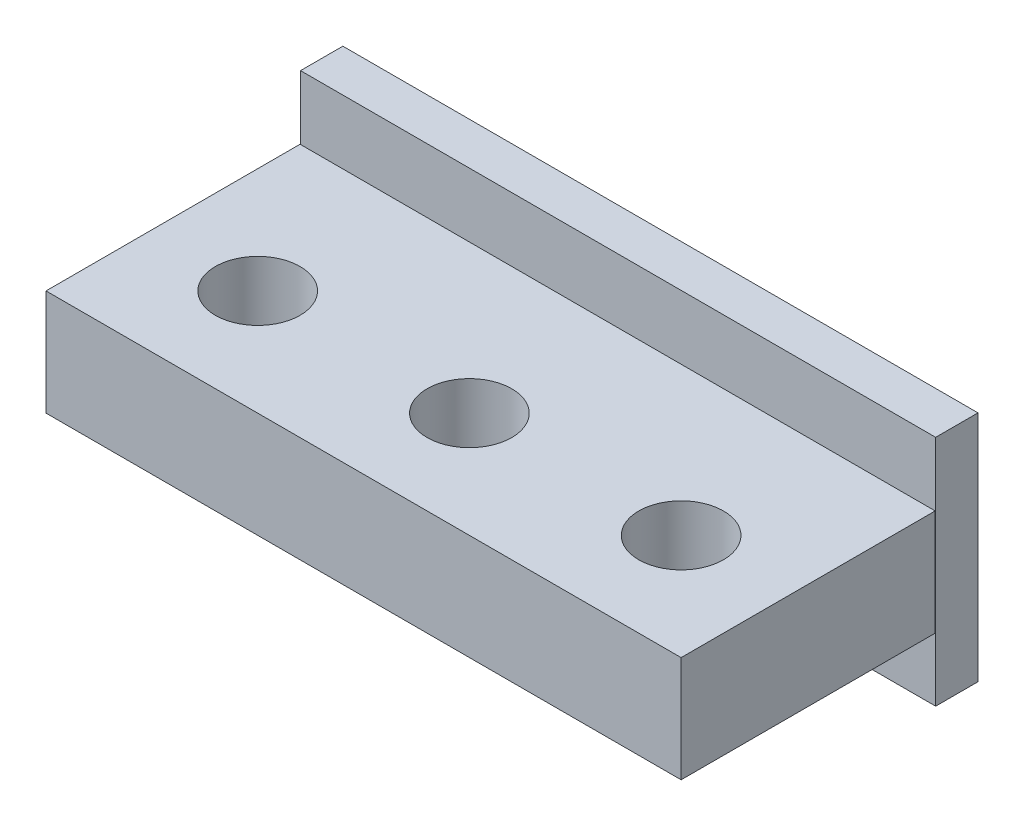
ISO-10303-21;
HEADER;
FILE_DESCRIPTION(('STEP AP214'),'2;1');
FILE_NAME('part.step','',(''),(''),'','','');
FILE_SCHEMA(('AUTOMOTIVE_DESIGN { 1 0 10303 214 1 1 1 1 }'));
ENDSEC;
DATA;
#1=APPLICATION_CONTEXT('core data for automotive mechanical design processes');
#2=APPLICATION_PROTOCOL_DEFINITION('international standard','automotive_design',2000,#1);
#3=PRODUCT_CONTEXT('',#1,'mechanical');
#4=PRODUCT('Part','Part','',(#3));
#5=PRODUCT_RELATED_PRODUCT_CATEGORY('part','',(#4));
#6=PRODUCT_DEFINITION_FORMATION('','',#4);
#7=PRODUCT_DEFINITION_CONTEXT('part definition',#1,'design');
#8=PRODUCT_DEFINITION('design','',#6,#7);
#9=PRODUCT_DEFINITION_SHAPE('','',#8);
#10=(LENGTH_UNIT() NAMED_UNIT(*) SI_UNIT(.MILLI.,.METRE.));
#11=(NAMED_UNIT(*) PLANE_ANGLE_UNIT() SI_UNIT($,.RADIAN.));
#12=(NAMED_UNIT(*) SI_UNIT($,.STERADIAN.) SOLID_ANGLE_UNIT());
#13=UNCERTAINTY_MEASURE_WITH_UNIT(LENGTH_MEASURE(1.E-05),#10,'distance_accuracy_value','');
#14=(GEOMETRIC_REPRESENTATION_CONTEXT(3) GLOBAL_UNCERTAINTY_ASSIGNED_CONTEXT((#13)) GLOBAL_UNIT_ASSIGNED_CONTEXT((#10,
#11,#12)) REPRESENTATION_CONTEXT('',''));
#15=CARTESIAN_POINT('',(0.,0.,0.));
#16=DIRECTION('',(0.,0.,1.));
#17=DIRECTION('',(1.,0.,0.));
#18=AXIS2_PLACEMENT_3D('',#15,#16,#17);
#19=CARTESIAN_POINT('',(-7.1712328677664,5.,10.9891849490103));
#20=DIRECTION('',(1.,0.,0.));
#21=DIRECTION('',(0.,0.,-1.));
#22=AXIS2_PLACEMENT_3D('',#19,#20,#21);
#23=PLANE('',#22);
#24=DIRECTION('',(0.,0.,1.));
#25=VECTOR('',#24,1.);
#26=CARTESIAN_POINT('',(-7.1712328677664,0.,10.9891849490103));
#27=LINE('',#26,#25);
#28=CARTESIAN_POINT('',(-7.1712328677664,0.,10.9891849490103));
#29=VERTEX_POINT('',#28);
#30=CARTESIAN_POINT('',(-7.1712328677664,0.,22.9891849490103));
#31=VERTEX_POINT('',#30);
#32=EDGE_CURVE('E141',#29,#31,#27,.T.);
#33=ORIENTED_EDGE('',*,*,#32,.T.);
#34=DIRECTION('',(0.,-1.,0.));
#35=VECTOR('',#34,1.);
#36=CARTESIAN_POINT('',(-7.1712328677664,5.,22.9891849490103));
#37=LINE('',#36,#35);
#38=CARTESIAN_POINT('',(-7.1712328677664,5.,22.9891849490103));
#39=VERTEX_POINT('',#38);
#40=EDGE_CURVE('E9',#39,#31,#37,.T.);
#41=ORIENTED_EDGE('',*,*,#40,.F.);
#42=DIRECTION('',(0.,0.,1.));
#43=VECTOR('',#42,1.);
#44=CARTESIAN_POINT('',(-7.1712328677664,5.,10.9891849490103));
#45=LINE('',#44,#43);
#46=CARTESIAN_POINT('',(-7.1712328677664,5.,10.9891849490103));
#47=VERTEX_POINT('',#46);
#48=EDGE_CURVE('E146',#47,#39,#45,.T.);
#49=ORIENTED_EDGE('',*,*,#48,.F.);
#50=DIRECTION('',(0.,-1.,0.));
#51=VECTOR('',#50,1.);
#52=CARTESIAN_POINT('',(-7.1712328677664,5.,10.9891849490103));
#53=LINE('',#52,#51);
#54=EDGE_CURVE('E149',#47,#29,#53,.T.);
#55=ORIENTED_EDGE('',*,*,#54,.T.);
#56=EDGE_LOOP('',(#33,#41,#49,#55));
#57=FACE_BOUND('',#56,.T.);
#58=ADVANCED_FACE('F15',(#57),#23,.F.);
#59=CARTESIAN_POINT('',(-7.1712328677664,5.,22.9891849490103));
#60=DIRECTION('',(0.,0.,-1.));
#61=DIRECTION('',(-1.,0.,0.));
#62=AXIS2_PLACEMENT_3D('',#59,#60,#61);
#63=PLANE('',#62);
#64=DIRECTION('',(1.,0.,0.));
#65=VECTOR('',#64,1.);
#66=CARTESIAN_POINT('',(-7.1712328677664,0.,22.9891849490103));
#67=LINE('',#66,#65);
#68=CARTESIAN_POINT('',(22.8287671322336,0.,22.9891849490103));
#69=VERTEX_POINT('',#68);
#70=EDGE_CURVE('E152',#31,#69,#67,.T.);
#71=ORIENTED_EDGE('',*,*,#70,.T.);
#72=DIRECTION('',(0.,-1.,0.));
#73=VECTOR('',#72,1.);
#74=CARTESIAN_POINT('',(22.8287671322336,5.,22.9891849490103));
#75=LINE('',#74,#73);
#76=CARTESIAN_POINT('',(22.8287671322336,5.,22.9891849490103));
#77=VERTEX_POINT('',#76);
#78=EDGE_CURVE('E25',#77,#69,#75,.T.);
#79=ORIENTED_EDGE('',*,*,#78,.F.);
#80=DIRECTION('',(1.,0.,0.));
#81=VECTOR('',#80,1.);
#82=CARTESIAN_POINT('',(-7.1712328677664,5.,22.9891849490103));
#83=LINE('',#82,#81);
#84=EDGE_CURVE('E142',#39,#77,#83,.T.);
#85=ORIENTED_EDGE('',*,*,#84,.F.);
#86=ORIENTED_EDGE('',*,*,#40,.T.);
#87=EDGE_LOOP('',(#71,#79,#85,#86));
#88=FACE_BOUND('',#87,.T.);
#89=ADVANCED_FACE('F359',(#88),#63,.F.);
#90=CARTESIAN_POINT('',(22.8287671322336,5.,22.9891849490103));
#91=DIRECTION('',(-1.,0.,0.));
#92=DIRECTION('',(0.,0.,1.));
#93=AXIS2_PLACEMENT_3D('',#90,#91,#92);
#94=PLANE('',#93);
#95=DIRECTION('',(0.,0.,-1.));
#96=VECTOR('',#95,1.);
#97=CARTESIAN_POINT('',(22.8287671322336,0.,22.9891849490103));
#98=LINE('',#97,#96);
#99=CARTESIAN_POINT('',(22.8287671322336,0.,10.9891849490103));
#100=VERTEX_POINT('',#99);
#101=EDGE_CURVE('E155',#69,#100,#98,.T.);
#102=ORIENTED_EDGE('',*,*,#101,.T.);
#103=DIRECTION('',(0.,-1.,0.));
#104=VECTOR('',#103,1.);
#105=CARTESIAN_POINT('',(22.8287671322336,5.,10.9891849490103));
#106=LINE('',#105,#104);
#107=CARTESIAN_POINT('',(22.8287671322336,5.,10.9891849490103));
#108=VERTEX_POINT('',#107);
#109=EDGE_CURVE('E165',#108,#100,#106,.T.);
#110=ORIENTED_EDGE('',*,*,#109,.F.);
#111=DIRECTION('',(0.,0.,-1.));
#112=VECTOR('',#111,1.);
#113=CARTESIAN_POINT('',(22.8287671322336,5.,22.9891849490103));
#114=LINE('',#113,#112);
#115=EDGE_CURVE('E145',#77,#108,#114,.T.);
#116=ORIENTED_EDGE('',*,*,#115,.F.);
#117=ORIENTED_EDGE('',*,*,#78,.T.);
#118=EDGE_LOOP('',(#102,#110,#116,#117));
#119=FACE_BOUND('',#118,.T.);
#120=ADVANCED_FACE('F347',(#119),#94,.F.);
#121=CARTESIAN_POINT('',(22.8287671322336,5.,10.9891849490103));
#122=DIRECTION('',(0.,0.,1.));
#123=DIRECTION('',(1.,0.,0.));
#124=AXIS2_PLACEMENT_3D('',#121,#122,#123);
#125=PLANE('',#124);
#126=DIRECTION('',(-1.,0.,0.));
#127=VECTOR('',#126,1.);
#128=CARTESIAN_POINT('',(22.8287671322336,0.,10.9891849490103));
#129=LINE('',#128,#127);
#130=EDGE_CURVE('E151',#100,#29,#129,.T.);
#131=ORIENTED_EDGE('',*,*,#130,.T.);
#132=ORIENTED_EDGE('',*,*,#54,.F.);
#133=DIRECTION('',(-1.,0.,0.));
#134=VECTOR('',#133,1.);
#135=CARTESIAN_POINT('',(22.8287671322336,5.,10.9891849490103));
#136=LINE('',#135,#134);
#137=EDGE_CURVE('E34',#108,#47,#136,.T.);
#138=ORIENTED_EDGE('',*,*,#137,.F.);
#139=ORIENTED_EDGE('',*,*,#109,.T.);
#140=EDGE_LOOP('',(#131,#132,#138,#139));
#141=FACE_BOUND('',#140,.T.);
#142=ADVANCED_FACE('F312',(#141),#125,.F.);
#143=CARTESIAN_POINT('',(0.,5.,0.));
#144=DIRECTION('',(0.,1.,0.));
#145=DIRECTION('',(0.,0.,1.));
#146=AXIS2_PLACEMENT_3D('',#143,#144,#145);
#147=PLANE('',#146);
#148=CARTESIAN_POINT('',(17.8287671322336,5.,17.9891849490103));
#149=DIRECTION('',(0.,1.,0.));
#150=DIRECTION('',(0.,0.,1.));
#151=AXIS2_PLACEMENT_3D('',#148,#149,#150);
#152=CIRCLE('',#151,2.);
#153=CARTESIAN_POINT('',(17.8287671322336,5.,19.9891849490103));
#154=VERTEX_POINT('',#153);
#155=EDGE_CURVE('E119',#154,#154,#152,.T.);
#156=ORIENTED_EDGE('',*,*,#155,.F.);
#157=EDGE_LOOP('',(#156));
#158=FACE_BOUND('',#157,.T.);
#159=CARTESIAN_POINT('',(7.8287671322336,5.,17.9891849490103));
#160=DIRECTION('',(0.,1.,0.));
#161=DIRECTION('',(0.,0.,1.));
#162=AXIS2_PLACEMENT_3D('',#159,#160,#161);
#163=CIRCLE('',#162,2.);
#164=CARTESIAN_POINT('',(7.8287671322336,5.,19.9891849490103));
#165=VERTEX_POINT('',#164);
#166=EDGE_CURVE('E131',#165,#165,#163,.T.);
#167=ORIENTED_EDGE('',*,*,#166,.F.);
#168=EDGE_LOOP('',(#167));
#169=FACE_BOUND('',#168,.T.);
#170=CARTESIAN_POINT('',(-2.1712328677664,5.,17.9891849490103));
#171=DIRECTION('',(0.,1.,0.));
#172=DIRECTION('',(0.,0.,1.));
#173=AXIS2_PLACEMENT_3D('',#170,#171,#172);
#174=CIRCLE('',#173,2.);
#175=CARTESIAN_POINT('',(-2.1712328677664,5.,19.9891849490103));
#176=VERTEX_POINT('',#175);
#177=EDGE_CURVE('E138',#176,#176,#174,.T.);
#178=ORIENTED_EDGE('',*,*,#177,.F.);
#179=EDGE_LOOP('',(#178));
#180=FACE_BOUND('',#179,.T.);
#181=ORIENTED_EDGE('',*,*,#48,.T.);
#182=ORIENTED_EDGE('',*,*,#84,.T.);
#183=ORIENTED_EDGE('',*,*,#115,.T.);
#184=ORIENTED_EDGE('',*,*,#137,.T.);
#185=EDGE_LOOP('',(#181,#182,#183,#184));
#186=FACE_BOUND('',#185,.T.);
#187=ADVANCED_FACE('F298',(#158,#169,#180,#186),#147,.T.);
#188=CARTESIAN_POINT('',(0.,0.,0.));
#189=DIRECTION('',(0.,1.,0.));
#190=DIRECTION('',(0.,0.,1.));
#191=AXIS2_PLACEMENT_3D('',#188,#189,#190);
#192=PLANE('',#191);
#193=CARTESIAN_POINT('',(17.8287671322336,0.,17.9891849490103));
#194=DIRECTION('',(0.,-1.,0.));
#195=DIRECTION('',(1.,0.,0.));
#196=AXIS2_PLACEMENT_3D('',#193,#194,#195);
#197=CIRCLE('',#196,2.);
#198=CARTESIAN_POINT('',(19.8287671322336,0.,17.9891849490103));
#199=VERTEX_POINT('',#198);
#200=EDGE_CURVE('E115',#199,#199,#197,.T.);
#201=ORIENTED_EDGE('',*,*,#200,.F.);
#202=EDGE_LOOP('',(#201));
#203=FACE_BOUND('',#202,.T.);
#204=CARTESIAN_POINT('',(7.8287671322336,0.,17.9891849490103));
#205=DIRECTION('',(0.,-1.,0.));
#206=DIRECTION('',(1.,0.,0.));
#207=AXIS2_PLACEMENT_3D('',#204,#205,#206);
#208=CIRCLE('',#207,2.);
#209=CARTESIAN_POINT('',(9.8287671322336,0.,17.9891849490103));
#210=VERTEX_POINT('',#209);
#211=EDGE_CURVE('E126',#210,#210,#208,.T.);
#212=ORIENTED_EDGE('',*,*,#211,.F.);
#213=EDGE_LOOP('',(#212));
#214=FACE_BOUND('',#213,.T.);
#215=CARTESIAN_POINT('',(-2.1712328677664,0.,17.9891849490103));
#216=DIRECTION('',(0.,-1.,0.));
#217=DIRECTION('',(1.,0.,0.));
#218=AXIS2_PLACEMENT_3D('',#215,#216,#217);
#219=CIRCLE('',#218,2.);
#220=CARTESIAN_POINT('',(-0.171232867766404,0.,17.9891849490103));
#221=VERTEX_POINT('',#220);
#222=EDGE_CURVE('E134',#221,#221,#219,.T.);
#223=ORIENTED_EDGE('',*,*,#222,.F.);
#224=EDGE_LOOP('',(#223));
#225=FACE_BOUND('',#224,.T.);
#226=ORIENTED_EDGE('',*,*,#32,.F.);
#227=ORIENTED_EDGE('',*,*,#130,.F.);
#228=ORIENTED_EDGE('',*,*,#101,.F.);
#229=ORIENTED_EDGE('',*,*,#70,.F.);
#230=EDGE_LOOP('',(#226,#227,#228,#229));
#231=FACE_BOUND('',#230,.T.);
#232=ADVANCED_FACE('F292',(#203,#214,#225,#231),#192,.F.);
#233=CARTESIAN_POINT('',(-2.1712328677664,32.6955654485436,17.9891849490103));
#234=DIRECTION('',(0.,-1.,0.));
#235=DIRECTION('',(0.,0.,-1.));
#236=AXIS2_PLACEMENT_3D('',#233,#234,#235);
#237=CYLINDRICAL_SURFACE('',#236,2.);
#238=ORIENTED_EDGE('',*,*,#222,.T.);
#239=EDGE_LOOP('',(#238));
#240=FACE_BOUND('',#239,.T.);
#241=ORIENTED_EDGE('',*,*,#177,.T.);
#242=EDGE_LOOP('',(#241));
#243=FACE_BOUND('',#242,.T.);
#244=ADVANCED_FACE('F297',(#240,#243),#237,.F.);
#245=CARTESIAN_POINT('',(7.8287671322336,32.6955654485436,17.9891849490103));
#246=DIRECTION('',(0.,-1.,0.));
#247=DIRECTION('',(0.,0.,-1.));
#248=AXIS2_PLACEMENT_3D('',#245,#246,#247);
#249=CYLINDRICAL_SURFACE('',#248,2.);
#250=ORIENTED_EDGE('',*,*,#211,.T.);
#251=EDGE_LOOP('',(#250));
#252=FACE_BOUND('',#251,.T.);
#253=ORIENTED_EDGE('',*,*,#166,.T.);
#254=EDGE_LOOP('',(#253));
#255=FACE_BOUND('',#254,.T.);
#256=ADVANCED_FACE('F280',(#252,#255),#249,.F.);
#257=CARTESIAN_POINT('',(17.8287671322336,32.6955654485436,17.9891849490103));
#258=DIRECTION('',(0.,-1.,0.));
#259=DIRECTION('',(0.,0.,-1.));
#260=AXIS2_PLACEMENT_3D('',#257,#258,#259);
#261=CYLINDRICAL_SURFACE('',#260,2.);
#262=ORIENTED_EDGE('',*,*,#200,.T.);
#263=EDGE_LOOP('',(#262));
#264=FACE_BOUND('',#263,.T.);
#265=ORIENTED_EDGE('',*,*,#155,.T.);
#266=EDGE_LOOP('',(#265));
#267=FACE_BOUND('',#266,.T.);
#268=ADVANCED_FACE('F206',(#264,#267),#261,.F.);
#269=CLOSED_SHELL('',(#58,#89,#120,#142,#187,#232,#244,#256,#268));
#270=MANIFOLD_SOLID_BREP('B1',#269);
#271=CARTESIAN_POINT('',(-7.1712328677664,-3.,8.96661962834522));
#272=DIRECTION('',(0.,1.,0.));
#273=DIRECTION('',(0.,0.,1.));
#274=AXIS2_PLACEMENT_3D('',#271,#272,#273);
#275=PLANE('',#274);
#276=DIRECTION('',(0.,0.,1.));
#277=VECTOR('',#276,1.);
#278=CARTESIAN_POINT('',(22.8287671322336,-3.,8.96661962834524));
#279=LINE('',#278,#277);
#280=CARTESIAN_POINT('',(22.8287671322336,-3.,8.96661962834524));
#281=VERTEX_POINT('',#280);
#282=CARTESIAN_POINT('',(22.8287671322336,-3.,10.9666196283452));
#283=VERTEX_POINT('',#282);
#284=EDGE_CURVE('E97',#281,#283,#279,.T.);
#285=ORIENTED_EDGE('',*,*,#284,.T.);
#286=DIRECTION('',(1.,0.,0.));
#287=VECTOR('',#286,1.);
#288=CARTESIAN_POINT('',(-7.1712328677664,-3.,10.9666196283452));
#289=LINE('',#288,#287);
#290=CARTESIAN_POINT('',(-7.1712328677664,-3.,10.9666196283452));
#291=VERTEX_POINT('',#290);
#292=EDGE_CURVE('E19',#291,#283,#289,.T.);
#293=ORIENTED_EDGE('',*,*,#292,.F.);
#294=DIRECTION('',(0.,0.,1.));
#295=VECTOR('',#294,1.);
#296=CARTESIAN_POINT('',(-7.1712328677664,-3.,8.96661962834522));
#297=LINE('',#296,#295);
#298=CARTESIAN_POINT('',(-7.1712328677664,-3.,8.96661962834522));
#299=VERTEX_POINT('',#298);
#300=EDGE_CURVE('E92',#299,#291,#297,.T.);
#301=ORIENTED_EDGE('',*,*,#300,.F.);
#302=DIRECTION('',(1.,0.,0.));
#303=VECTOR('',#302,1.);
#304=CARTESIAN_POINT('',(-7.1712328677664,-3.,8.96661962834522));
#305=LINE('',#304,#303);
#306=EDGE_CURVE('E86',#299,#281,#305,.T.);
#307=ORIENTED_EDGE('',*,*,#306,.T.);
#308=EDGE_LOOP('',(#285,#293,#301,#307));
#309=FACE_BOUND('',#308,.T.);
#310=ADVANCED_FACE('F17',(#309),#275,.F.);
#311=CARTESIAN_POINT('',(-7.1712328677664,-3.,10.9666196283452));
#312=DIRECTION('',(0.,0.,-1.));
#313=DIRECTION('',(-1.,0.,0.));
#314=AXIS2_PLACEMENT_3D('',#311,#312,#313);
#315=PLANE('',#314);
#316=DIRECTION('',(0.,1.,0.));
#317=VECTOR('',#316,1.);
#318=CARTESIAN_POINT('',(22.8287671322336,-3.,10.9666196283452));
#319=LINE('',#318,#317);
#320=CARTESIAN_POINT('',(22.8287671322336,8.,10.9666196283452));
#321=VERTEX_POINT('',#320);
#322=EDGE_CURVE('E102',#283,#321,#319,.T.);
#323=ORIENTED_EDGE('',*,*,#322,.T.);
#324=DIRECTION('',(1.,0.,0.));
#325=VECTOR('',#324,1.);
#326=CARTESIAN_POINT('',(-7.1712328677664,8.,10.9666196283452));
#327=LINE('',#326,#325);
#328=CARTESIAN_POINT('',(-7.1712328677664,8.,10.9666196283452));
#329=VERTEX_POINT('',#328);
#330=EDGE_CURVE('E112',#329,#321,#327,.T.);
#331=ORIENTED_EDGE('',*,*,#330,.F.);
#332=DIRECTION('',(0.,1.,0.));
#333=VECTOR('',#332,1.);
#334=CARTESIAN_POINT('',(-7.1712328677664,-3.,10.9666196283452));
#335=LINE('',#334,#333);
#336=EDGE_CURVE('E170',#291,#329,#335,.T.);
#337=ORIENTED_EDGE('',*,*,#336,.F.);
#338=ORIENTED_EDGE('',*,*,#292,.T.);
#339=EDGE_LOOP('',(#323,#331,#337,#338));
#340=FACE_BOUND('',#339,.T.);
#341=ADVANCED_FACE('F185',(#340),#315,.F.);
#342=CARTESIAN_POINT('',(-7.1712328677664,8.,10.9666196283452));
#343=DIRECTION('',(0.,-1.,0.));
#344=DIRECTION('',(0.,0.,-1.));
#345=AXIS2_PLACEMENT_3D('',#342,#343,#344);
#346=PLANE('',#345);
#347=DIRECTION('',(0.,0.,-1.));
#348=VECTOR('',#347,1.);
#349=CARTESIAN_POINT('',(22.8287671322336,8.,10.9666196283452));
#350=LINE('',#349,#348);
#351=CARTESIAN_POINT('',(22.8287671322336,8.,8.96661962834524));
#352=VERTEX_POINT('',#351);
#353=EDGE_CURVE('E76',#321,#352,#350,.T.);
#354=ORIENTED_EDGE('',*,*,#353,.T.);
#355=DIRECTION('',(1.,0.,0.));
#356=VECTOR('',#355,1.);
#357=CARTESIAN_POINT('',(-7.1712328677664,8.,8.96661962834523));
#358=LINE('',#357,#356);
#359=CARTESIAN_POINT('',(-7.1712328677664,8.,8.96661962834523));
#360=VERTEX_POINT('',#359);
#361=EDGE_CURVE('E88',#360,#352,#358,.T.);
#362=ORIENTED_EDGE('',*,*,#361,.F.);
#363=DIRECTION('',(0.,0.,-1.));
#364=VECTOR('',#363,1.);
#365=CARTESIAN_POINT('',(-7.1712328677664,8.,10.9666196283452));
#366=LINE('',#365,#364);
#367=EDGE_CURVE('E172',#329,#360,#366,.T.);
#368=ORIENTED_EDGE('',*,*,#367,.F.);
#369=ORIENTED_EDGE('',*,*,#330,.T.);
#370=EDGE_LOOP('',(#354,#362,#368,#369));
#371=FACE_BOUND('',#370,.T.);
#372=ADVANCED_FACE('F183',(#371),#346,.F.);
#373=CARTESIAN_POINT('',(-7.1712328677664,8.,8.96661962834523));
#374=DIRECTION('',(0.,0.,1.));
#375=DIRECTION('',(1.,0.,0.));
#376=AXIS2_PLACEMENT_3D('',#373,#374,#375);
#377=PLANE('',#376);
#378=DIRECTION('',(0.,-1.,0.));
#379=VECTOR('',#378,1.);
#380=CARTESIAN_POINT('',(22.8287671322336,8.,8.96661962834524));
#381=LINE('',#380,#379);
#382=EDGE_CURVE('E82',#352,#281,#381,.T.);
#383=ORIENTED_EDGE('',*,*,#382,.T.);
#384=ORIENTED_EDGE('',*,*,#306,.F.);
#385=DIRECTION('',(0.,-1.,0.));
#386=VECTOR('',#385,1.);
#387=CARTESIAN_POINT('',(-7.1712328677664,8.,8.96661962834523));
#388=LINE('',#387,#386);
#389=EDGE_CURVE('E99',#360,#299,#388,.T.);
#390=ORIENTED_EDGE('',*,*,#389,.F.);
#391=ORIENTED_EDGE('',*,*,#361,.T.);
#392=EDGE_LOOP('',(#383,#384,#390,#391));
#393=FACE_BOUND('',#392,.T.);
#394=ADVANCED_FACE('F84',(#393),#377,.F.);
#395=CARTESIAN_POINT('',(-7.1712328677664,0.,0.));
#396=DIRECTION('',(-1.,0.,0.));
#397=DIRECTION('',(0.,0.,1.));
#398=AXIS2_PLACEMENT_3D('',#395,#396,#397);
#399=PLANE('',#398);
#400=ORIENTED_EDGE('',*,*,#300,.T.);
#401=ORIENTED_EDGE('',*,*,#336,.T.);
#402=ORIENTED_EDGE('',*,*,#367,.T.);
#403=ORIENTED_EDGE('',*,*,#389,.T.);
#404=EDGE_LOOP('',(#400,#401,#402,#403));
#405=FACE_BOUND('',#404,.T.);
#406=ADVANCED_FACE('F182',(#405),#399,.T.);
#407=CARTESIAN_POINT('',(22.8287671322336,0.,0.));
#408=DIRECTION('',(-1.,0.,0.));
#409=DIRECTION('',(0.,0.,1.));
#410=AXIS2_PLACEMENT_3D('',#407,#408,#409);
#411=PLANE('',#410);
#412=ORIENTED_EDGE('',*,*,#284,.F.);
#413=ORIENTED_EDGE('',*,*,#382,.F.);
#414=ORIENTED_EDGE('',*,*,#353,.F.);
#415=ORIENTED_EDGE('',*,*,#322,.F.);
#416=EDGE_LOOP('',(#412,#413,#414,#415));
#417=FACE_BOUND('',#416,.T.);
#418=ADVANCED_FACE('F101',(#417),#411,.F.);
#419=CLOSED_SHELL('',(#310,#341,#372,#394,#406,#418));
#420=MANIFOLD_SOLID_BREP('B1',#419);
#421=ADVANCED_BREP_SHAPE_REPRESENTATION('',(#18,#270,#420),#14);
#422=SHAPE_DEFINITION_REPRESENTATION(#9,#421);
ENDSEC;
END-ISO-10303-21;
